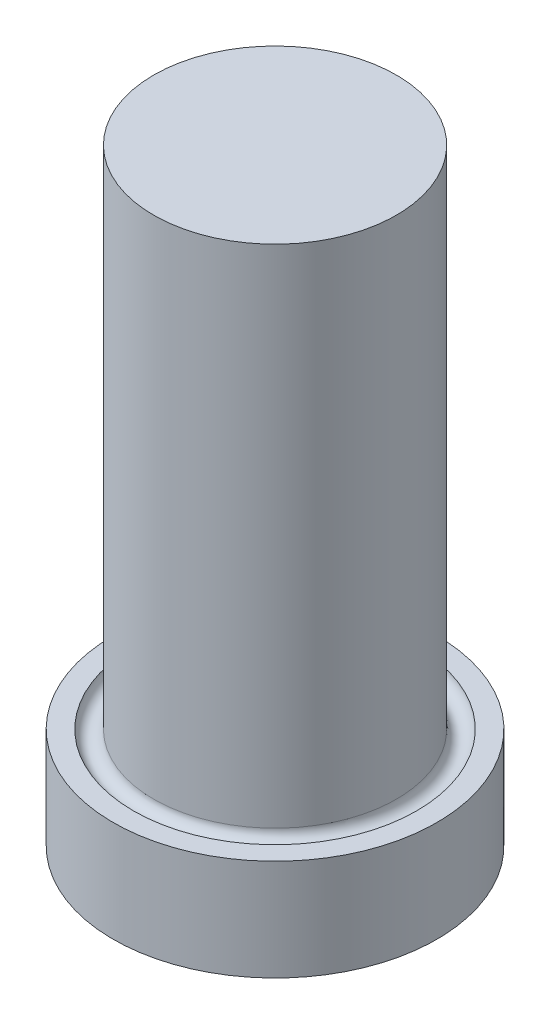
ISO-10303-21;
HEADER;
FILE_DESCRIPTION(('STEP AP214'),'2;1');
FILE_NAME('part.step','',(''),(''),'','','');
FILE_SCHEMA(('AUTOMOTIVE_DESIGN { 1 0 10303 214 1 1 1 1 }'));
ENDSEC;
DATA;
#1=APPLICATION_CONTEXT('core data for automotive mechanical design processes');
#2=APPLICATION_PROTOCOL_DEFINITION('international standard','automotive_design',2000,#1);
#3=PRODUCT_CONTEXT('',#1,'mechanical');
#4=PRODUCT('Part','Part','',(#3));
#5=PRODUCT_RELATED_PRODUCT_CATEGORY('part','',(#4));
#6=PRODUCT_DEFINITION_FORMATION('','',#4);
#7=PRODUCT_DEFINITION_CONTEXT('part definition',#1,'design');
#8=PRODUCT_DEFINITION('design','',#6,#7);
#9=PRODUCT_DEFINITION_SHAPE('','',#8);
#10=(LENGTH_UNIT() NAMED_UNIT(*) SI_UNIT(.MILLI.,.METRE.));
#11=(NAMED_UNIT(*) PLANE_ANGLE_UNIT() SI_UNIT($,.RADIAN.));
#12=(NAMED_UNIT(*) SI_UNIT($,.STERADIAN.) SOLID_ANGLE_UNIT());
#13=UNCERTAINTY_MEASURE_WITH_UNIT(LENGTH_MEASURE(1.E-05),#10,'distance_accuracy_value','');
#14=(GEOMETRIC_REPRESENTATION_CONTEXT(3) GLOBAL_UNCERTAINTY_ASSIGNED_CONTEXT((#13)) GLOBAL_UNIT_ASSIGNED_CONTEXT((#10,
#11,#12)) REPRESENTATION_CONTEXT('',''));
#15=CARTESIAN_POINT('',(0.,0.,0.));
#16=DIRECTION('',(0.,0.,1.));
#17=DIRECTION('',(1.,0.,0.));
#18=AXIS2_PLACEMENT_3D('',#15,#16,#17);
#19=CARTESIAN_POINT('',(0.,0.,0.));
#20=DIRECTION('',(0.,-1.,0.));
#21=DIRECTION('',(1.,0.,0.));
#22=AXIS2_PLACEMENT_3D('',#19,#20,#21);
#23=PLANE('',#22);
#24=CARTESIAN_POINT('',(0.,0.,0.));
#25=DIRECTION('',(0.,1.,0.));
#26=DIRECTION('',(-1.,0.,0.));
#27=AXIS2_PLACEMENT_3D('',#24,#25,#26);
#28=CIRCLE('',#27,6.);
#29=CARTESIAN_POINT('',(-6.,0.,0.));
#30=VERTEX_POINT('',#29);
#31=EDGE_CURVE('E50',#30,#30,#28,.T.);
#32=ORIENTED_EDGE('',*,*,#31,.T.);
#33=EDGE_LOOP('',(#32));
#34=FACE_BOUND('',#33,.T.);
#35=ADVANCED_FACE('F31',(#34),#23,.F.);
#36=CARTESIAN_POINT('',(0.,-30.,0.));
#37=DIRECTION('',(0.,1.,0.));
#38=DIRECTION('',(-1.,0.,0.));
#39=AXIS2_PLACEMENT_3D('',#36,#37,#38);
#40=PLANE('',#39);
#41=CARTESIAN_POINT('',(0.,-30.,0.));
#42=DIRECTION('',(0.,1.,0.));
#43=DIRECTION('',(-1.,0.,0.));
#44=AXIS2_PLACEMENT_3D('',#41,#42,#43);
#45=CIRCLE('',#44,8.);
#46=CARTESIAN_POINT('',(-8.,-30.,0.));
#47=VERTEX_POINT('',#46);
#48=EDGE_CURVE('E10',#47,#47,#45,.T.);
#49=ORIENTED_EDGE('',*,*,#48,.F.);
#50=EDGE_LOOP('',(#49));
#51=FACE_BOUND('',#50,.T.);
#52=ADVANCED_FACE('F74',(#51),#40,.F.);
#53=CARTESIAN_POINT('',(0.,0.,0.));
#54=DIRECTION('',(0.,1.,0.));
#55=DIRECTION('',(-1.,0.,0.));
#56=AXIS2_PLACEMENT_3D('',#53,#54,#55);
#57=CYLINDRICAL_SURFACE('',#56,8.);
#58=CARTESIAN_POINT('',(0.,-25.,0.));
#59=DIRECTION('',(0.,1.,0.));
#60=DIRECTION('',(-1.,0.,0.));
#61=AXIS2_PLACEMENT_3D('',#58,#59,#60);
#62=CIRCLE('',#61,8.);
#63=CARTESIAN_POINT('',(-7.99999999999999,-25.,0.));
#64=VERTEX_POINT('',#63);
#65=EDGE_CURVE('E37',#64,#64,#62,.T.);
#66=ORIENTED_EDGE('',*,*,#65,.F.);
#67=EDGE_LOOP('',(#66));
#68=FACE_BOUND('',#67,.T.);
#69=ORIENTED_EDGE('',*,*,#48,.T.);
#70=EDGE_LOOP('',(#69));
#71=FACE_BOUND('',#70,.T.);
#72=ADVANCED_FACE('F69',(#68,#71),#57,.T.);
#73=CARTESIAN_POINT('',(7.,-25.,0.));
#74=DIRECTION('',(0.,-1.,0.));
#75=DIRECTION('',(1.,0.,0.));
#76=AXIS2_PLACEMENT_3D('',#73,#74,#75);
#77=PLANE('',#76);
#78=CARTESIAN_POINT('',(0.,-25.,0.));
#79=DIRECTION('',(0.,1.,0.));
#80=DIRECTION('',(-1.,0.,0.));
#81=AXIS2_PLACEMENT_3D('',#78,#79,#80);
#82=CIRCLE('',#81,7.);
#83=CARTESIAN_POINT('',(-7.,-25.,0.));
#84=VERTEX_POINT('',#83);
#85=EDGE_CURVE('E41',#84,#84,#82,.T.);
#86=ORIENTED_EDGE('',*,*,#85,.F.);
#87=EDGE_LOOP('',(#86));
#88=FACE_BOUND('',#87,.T.);
#89=ORIENTED_EDGE('',*,*,#65,.T.);
#90=EDGE_LOOP('',(#89));
#91=FACE_BOUND('',#90,.T.);
#92=ADVANCED_FACE('F64',(#88,#91),#77,.F.);
#93=CARTESIAN_POINT('',(0.,-25.,0.));
#94=DIRECTION('',(0.,1.,0.));
#95=DIRECTION('',(-1.,0.,0.));
#96=AXIS2_PLACEMENT_3D('',#93,#94,#95);
#97=TOROIDAL_SURFACE('',#96,6.5,0.5);
#98=CARTESIAN_POINT('',(0.,-25.,0.));
#99=DIRECTION('',(0.,1.,0.));
#100=DIRECTION('',(-1.,0.,0.));
#101=AXIS2_PLACEMENT_3D('',#98,#99,#100);
#102=CIRCLE('',#101,6.);
#103=CARTESIAN_POINT('',(-6.,-25.,0.));
#104=VERTEX_POINT('',#103);
#105=EDGE_CURVE('E45',#104,#104,#102,.T.);
#106=ORIENTED_EDGE('',*,*,#105,.F.);
#107=EDGE_LOOP('',(#106));
#108=FACE_BOUND('',#107,.T.);
#109=ORIENTED_EDGE('',*,*,#85,.T.);
#110=EDGE_LOOP('',(#109));
#111=FACE_BOUND('',#110,.T.);
#112=ADVANCED_FACE('F58',(#108,#111),#97,.F.);
#113=CARTESIAN_POINT('',(0.,0.,0.));
#114=DIRECTION('',(0.,1.,0.));
#115=DIRECTION('',(-1.,0.,0.));
#116=AXIS2_PLACEMENT_3D('',#113,#114,#115);
#117=CYLINDRICAL_SURFACE('',#116,6.);
#118=ORIENTED_EDGE('',*,*,#31,.F.);
#119=EDGE_LOOP('',(#118));
#120=FACE_BOUND('',#119,.T.);
#121=ORIENTED_EDGE('',*,*,#105,.T.);
#122=EDGE_LOOP('',(#121));
#123=FACE_BOUND('',#122,.T.);
#124=ADVANCED_FACE('F55',(#120,#123),#117,.T.);
#125=CLOSED_SHELL('',(#35,#52,#72,#92,#112,#124));
#126=MANIFOLD_SOLID_BREP('B2',#125);
#127=ADVANCED_BREP_SHAPE_REPRESENTATION('',(#18,#126),#14);
#128=SHAPE_DEFINITION_REPRESENTATION(#9,#127);
ENDSEC;
END-ISO-10303-21;
